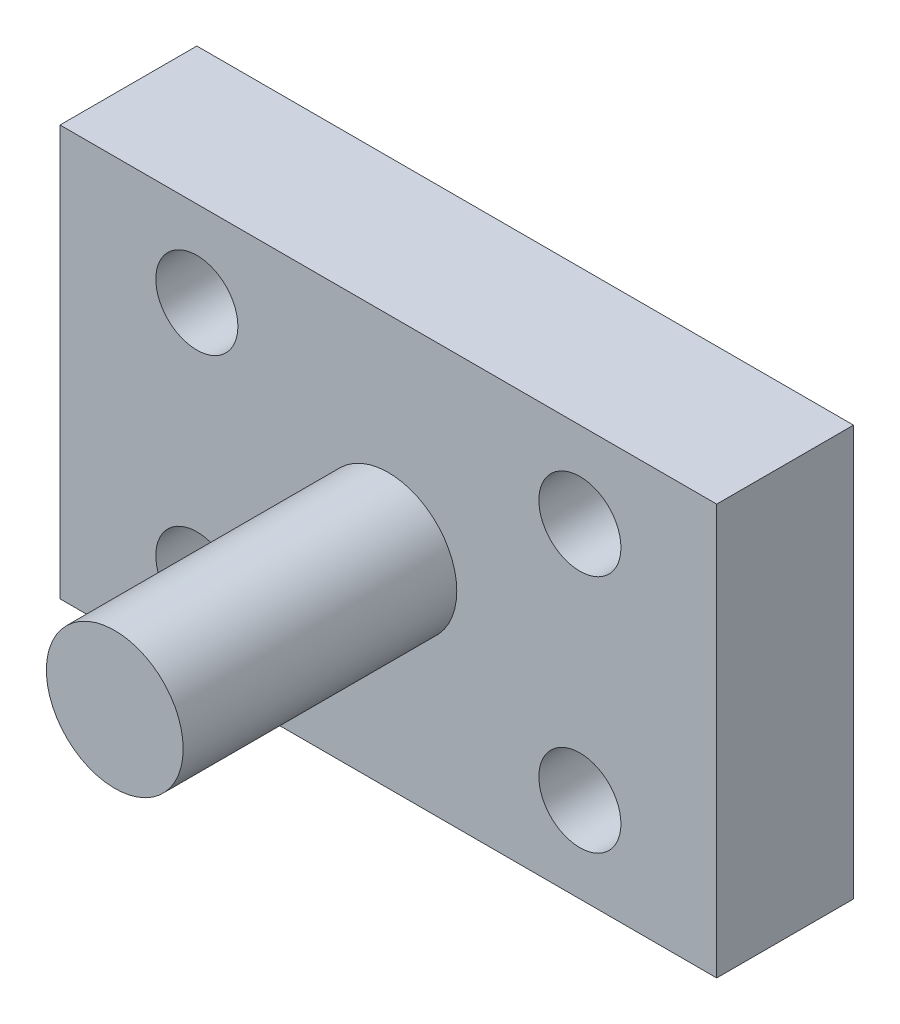
ISO-10303-21;
HEADER;
FILE_DESCRIPTION(('STEP AP214'),'2;1');
FILE_NAME('part.step','',(''),(''),'','','');
FILE_SCHEMA(('AUTOMOTIVE_DESIGN { 1 0 10303 214 1 1 1 1 }'));
ENDSEC;
DATA;
#1=APPLICATION_CONTEXT('core data for automotive mechanical design processes');
#2=APPLICATION_PROTOCOL_DEFINITION('international standard','automotive_design',2000,#1);
#3=PRODUCT_CONTEXT('',#1,'mechanical');
#4=PRODUCT('Part','Part','',(#3));
#5=PRODUCT_RELATED_PRODUCT_CATEGORY('part','',(#4));
#6=PRODUCT_DEFINITION_FORMATION('','',#4);
#7=PRODUCT_DEFINITION_CONTEXT('part definition',#1,'design');
#8=PRODUCT_DEFINITION('design','',#6,#7);
#9=PRODUCT_DEFINITION_SHAPE('','',#8);
#10=(LENGTH_UNIT() NAMED_UNIT(*) SI_UNIT(.MILLI.,.METRE.));
#11=(NAMED_UNIT(*) PLANE_ANGLE_UNIT() SI_UNIT($,.RADIAN.));
#12=(NAMED_UNIT(*) SI_UNIT($,.STERADIAN.) SOLID_ANGLE_UNIT());
#13=UNCERTAINTY_MEASURE_WITH_UNIT(LENGTH_MEASURE(1.E-05),#10,'distance_accuracy_value','');
#14=(GEOMETRIC_REPRESENTATION_CONTEXT(3) GLOBAL_UNCERTAINTY_ASSIGNED_CONTEXT((#13)) GLOBAL_UNIT_ASSIGNED_CONTEXT((#10,
#11,#12)) REPRESENTATION_CONTEXT('',''));
#15=CARTESIAN_POINT('',(0.,0.,0.));
#16=DIRECTION('',(0.,0.,1.));
#17=DIRECTION('',(1.,0.,0.));
#18=AXIS2_PLACEMENT_3D('',#15,#16,#17);
#19=CARTESIAN_POINT('',(0.,0.,25.));
#20=DIRECTION('',(0.,0.,1.));
#21=DIRECTION('',(1.,0.,0.));
#22=AXIS2_PLACEMENT_3D('',#19,#20,#21);
#23=PLANE('',#22);
#24=CARTESIAN_POINT('',(0.,0.,25.));
#25=DIRECTION('',(0.,0.,1.));
#26=DIRECTION('',(1.,0.,0.));
#27=AXIS2_PLACEMENT_3D('',#24,#25,#26);
#28=CIRCLE('',#27,12.5);
#29=CARTESIAN_POINT('',(12.5,0.,25.));
#30=VERTEX_POINT('',#29);
#31=EDGE_CURVE('E138',#30,#30,#28,.T.);
#32=ORIENTED_EDGE('',*,*,#31,.F.);
#33=EDGE_LOOP('',(#32));
#34=FACE_BOUND('',#33,.T.);
#35=CARTESIAN_POINT('',(-35.,-21.875,25.));
#36=DIRECTION('',(0.,0.,1.));
#37=DIRECTION('',(1.,0.,0.));
#38=AXIS2_PLACEMENT_3D('',#35,#36,#37);
#39=CIRCLE('',#38,7.5);
#40=CARTESIAN_POINT('',(-27.5,-21.875,25.));
#41=VERTEX_POINT('',#40);
#42=EDGE_CURVE('E123',#41,#41,#39,.T.);
#43=ORIENTED_EDGE('',*,*,#42,.F.);
#44=EDGE_LOOP('',(#43));
#45=FACE_BOUND('',#44,.T.);
#46=CARTESIAN_POINT('',(35.,21.875,25.));
#47=DIRECTION('',(0.,0.,1.));
#48=DIRECTION('',(1.,0.,0.));
#49=AXIS2_PLACEMENT_3D('',#46,#47,#48);
#50=CIRCLE('',#49,7.5);
#51=CARTESIAN_POINT('',(42.5,21.875,25.));
#52=VERTEX_POINT('',#51);
#53=EDGE_CURVE('E102',#52,#52,#50,.T.);
#54=ORIENTED_EDGE('',*,*,#53,.F.);
#55=EDGE_LOOP('',(#54));
#56=FACE_BOUND('',#55,.T.);
#57=DIRECTION('',(0.,1.,0.));
#58=VECTOR('',#57,1.);
#59=CARTESIAN_POINT('',(60.,37.5,25.));
#60=LINE('',#59,#58);
#61=CARTESIAN_POINT('',(60.,-37.5,25.));
#62=VERTEX_POINT('',#61);
#63=CARTESIAN_POINT('',(60.,37.5,25.));
#64=VERTEX_POINT('',#63);
#65=EDGE_CURVE('E87',#62,#64,#60,.T.);
#66=ORIENTED_EDGE('',*,*,#65,.T.);
#67=DIRECTION('',(-1.,0.,0.));
#68=VECTOR('',#67,1.);
#69=CARTESIAN_POINT('',(-60.,37.5,25.));
#70=LINE('',#69,#68);
#71=CARTESIAN_POINT('',(-60.,37.5,25.));
#72=VERTEX_POINT('',#71);
#73=EDGE_CURVE('E82',#64,#72,#70,.T.);
#74=ORIENTED_EDGE('',*,*,#73,.T.);
#75=DIRECTION('',(0.,-1.,0.));
#76=VECTOR('',#75,1.);
#77=CARTESIAN_POINT('',(-60.,37.5,25.));
#78=LINE('',#77,#76);
#79=CARTESIAN_POINT('',(-60.,-37.5,25.));
#80=VERTEX_POINT('',#79);
#81=EDGE_CURVE('E85',#72,#80,#78,.T.);
#82=ORIENTED_EDGE('',*,*,#81,.T.);
#83=DIRECTION('',(1.,0.,0.));
#84=VECTOR('',#83,1.);
#85=CARTESIAN_POINT('',(-60.,-37.5,25.));
#86=LINE('',#85,#84);
#87=EDGE_CURVE('E52',#80,#62,#86,.T.);
#88=ORIENTED_EDGE('',*,*,#87,.T.);
#89=EDGE_LOOP('',(#66,#74,#82,#88));
#90=FACE_BOUND('',#89,.T.);
#91=CARTESIAN_POINT('',(-35.,21.875,25.));
#92=DIRECTION('',(0.,0.,1.));
#93=DIRECTION('',(1.,0.,0.));
#94=AXIS2_PLACEMENT_3D('',#91,#92,#93);
#95=CIRCLE('',#94,7.5);
#96=CARTESIAN_POINT('',(-27.5,21.875,25.));
#97=VERTEX_POINT('',#96);
#98=EDGE_CURVE('E117',#97,#97,#95,.T.);
#99=ORIENTED_EDGE('',*,*,#98,.F.);
#100=EDGE_LOOP('',(#99));
#101=FACE_BOUND('',#100,.T.);
#102=CARTESIAN_POINT('',(35.,-21.875,25.));
#103=DIRECTION('',(0.,0.,1.));
#104=DIRECTION('',(1.,0.,0.));
#105=AXIS2_PLACEMENT_3D('',#102,#103,#104);
#106=CIRCLE('',#105,7.5);
#107=CARTESIAN_POINT('',(42.5,-21.875,25.));
#108=VERTEX_POINT('',#107);
#109=EDGE_CURVE('E129',#108,#108,#106,.T.);
#110=ORIENTED_EDGE('',*,*,#109,.F.);
#111=EDGE_LOOP('',(#110));
#112=FACE_BOUND('',#111,.T.);
#113=ADVANCED_FACE('F35',(#34,#45,#56,#90,#101,#112),#23,.T.);
#114=CARTESIAN_POINT('',(0.,0.,0.));
#115=DIRECTION('',(0.,0.,1.));
#116=DIRECTION('',(1.,0.,0.));
#117=AXIS2_PLACEMENT_3D('',#114,#115,#116);
#118=PLANE('',#117);
#119=DIRECTION('',(0.,1.,0.));
#120=VECTOR('',#119,1.);
#121=CARTESIAN_POINT('',(60.,37.5,0.));
#122=LINE('',#121,#120);
#123=CARTESIAN_POINT('',(60.,-37.5,0.));
#124=VERTEX_POINT('',#123);
#125=CARTESIAN_POINT('',(60.,37.5,0.));
#126=VERTEX_POINT('',#125);
#127=EDGE_CURVE('E99',#124,#126,#122,.T.);
#128=ORIENTED_EDGE('',*,*,#127,.F.);
#129=DIRECTION('',(1.,0.,0.));
#130=VECTOR('',#129,1.);
#131=CARTESIAN_POINT('',(-60.,-37.5,0.));
#132=LINE('',#131,#130);
#133=CARTESIAN_POINT('',(-60.,-37.5,0.));
#134=VERTEX_POINT('',#133);
#135=EDGE_CURVE('E75',#134,#124,#132,.T.);
#136=ORIENTED_EDGE('',*,*,#135,.F.);
#137=DIRECTION('',(0.,-1.,0.));
#138=VECTOR('',#137,1.);
#139=CARTESIAN_POINT('',(-60.,37.5,0.));
#140=LINE('',#139,#138);
#141=CARTESIAN_POINT('',(-60.,37.5,0.));
#142=VERTEX_POINT('',#141);
#143=EDGE_CURVE('E69',#142,#134,#140,.T.);
#144=ORIENTED_EDGE('',*,*,#143,.F.);
#145=DIRECTION('',(-1.,0.,0.));
#146=VECTOR('',#145,1.);
#147=CARTESIAN_POINT('',(-60.,37.5,0.));
#148=LINE('',#147,#146);
#149=EDGE_CURVE('E91',#126,#142,#148,.T.);
#150=ORIENTED_EDGE('',*,*,#149,.F.);
#151=EDGE_LOOP('',(#128,#136,#144,#150));
#152=FACE_BOUND('',#151,.T.);
#153=CARTESIAN_POINT('',(35.,21.875,0.));
#154=DIRECTION('',(0.,0.,1.));
#155=DIRECTION('',(1.,0.,0.));
#156=AXIS2_PLACEMENT_3D('',#153,#154,#155);
#157=CIRCLE('',#156,7.5);
#158=CARTESIAN_POINT('',(42.5,21.875,0.));
#159=VERTEX_POINT('',#158);
#160=EDGE_CURVE('E114',#159,#159,#157,.T.);
#161=ORIENTED_EDGE('',*,*,#160,.T.);
#162=EDGE_LOOP('',(#161));
#163=FACE_BOUND('',#162,.T.);
#164=CARTESIAN_POINT('',(-35.,21.875,0.));
#165=DIRECTION('',(0.,0.,1.));
#166=DIRECTION('',(1.,0.,0.));
#167=AXIS2_PLACEMENT_3D('',#164,#165,#166);
#168=CIRCLE('',#167,7.5);
#169=CARTESIAN_POINT('',(-27.5,21.875,0.));
#170=VERTEX_POINT('',#169);
#171=EDGE_CURVE('E120',#170,#170,#168,.T.);
#172=ORIENTED_EDGE('',*,*,#171,.T.);
#173=EDGE_LOOP('',(#172));
#174=FACE_BOUND('',#173,.T.);
#175=CARTESIAN_POINT('',(-35.,-21.875,0.));
#176=DIRECTION('',(0.,0.,1.));
#177=DIRECTION('',(1.,0.,0.));
#178=AXIS2_PLACEMENT_3D('',#175,#176,#177);
#179=CIRCLE('',#178,7.5);
#180=CARTESIAN_POINT('',(-27.5,-21.875,0.));
#181=VERTEX_POINT('',#180);
#182=EDGE_CURVE('E126',#181,#181,#179,.T.);
#183=ORIENTED_EDGE('',*,*,#182,.T.);
#184=EDGE_LOOP('',(#183));
#185=FACE_BOUND('',#184,.T.);
#186=CARTESIAN_POINT('',(35.,-21.875,0.));
#187=DIRECTION('',(0.,0.,1.));
#188=DIRECTION('',(1.,0.,0.));
#189=AXIS2_PLACEMENT_3D('',#186,#187,#188);
#190=CIRCLE('',#189,7.5);
#191=CARTESIAN_POINT('',(42.5,-21.875,0.));
#192=VERTEX_POINT('',#191);
#193=EDGE_CURVE('E132',#192,#192,#190,.T.);
#194=ORIENTED_EDGE('',*,*,#193,.T.);
#195=EDGE_LOOP('',(#194));
#196=FACE_BOUND('',#195,.T.);
#197=ADVANCED_FACE('F110',(#152,#163,#174,#185,#196),#118,.F.);
#198=CARTESIAN_POINT('',(60.,37.5,25.));
#199=DIRECTION('',(-1.,0.,0.));
#200=DIRECTION('',(0.,0.,1.));
#201=AXIS2_PLACEMENT_3D('',#198,#199,#200);
#202=PLANE('',#201);
#203=ORIENTED_EDGE('',*,*,#127,.T.);
#204=DIRECTION('',(0.,0.,-1.));
#205=VECTOR('',#204,1.);
#206=CARTESIAN_POINT('',(60.,37.5,25.));
#207=LINE('',#206,#205);
#208=EDGE_CURVE('E11',#64,#126,#207,.T.);
#209=ORIENTED_EDGE('',*,*,#208,.F.);
#210=ORIENTED_EDGE('',*,*,#65,.F.);
#211=DIRECTION('',(0.,0.,-1.));
#212=VECTOR('',#211,1.);
#213=CARTESIAN_POINT('',(60.,-37.5,25.));
#214=LINE('',#213,#212);
#215=EDGE_CURVE('E95',#62,#124,#214,.T.);
#216=ORIENTED_EDGE('',*,*,#215,.T.);
#217=EDGE_LOOP('',(#203,#209,#210,#216));
#218=FACE_BOUND('',#217,.T.);
#219=ADVANCED_FACE('F37',(#218),#202,.F.);
#220=CARTESIAN_POINT('',(-60.,37.5,25.));
#221=DIRECTION('',(0.,-1.,0.));
#222=DIRECTION('',(0.,0.,-1.));
#223=AXIS2_PLACEMENT_3D('',#220,#221,#222);
#224=PLANE('',#223);
#225=ORIENTED_EDGE('',*,*,#149,.T.);
#226=DIRECTION('',(0.,0.,-1.));
#227=VECTOR('',#226,1.);
#228=CARTESIAN_POINT('',(-60.,37.5,25.));
#229=LINE('',#228,#227);
#230=EDGE_CURVE('E44',#72,#142,#229,.T.);
#231=ORIENTED_EDGE('',*,*,#230,.F.);
#232=ORIENTED_EDGE('',*,*,#73,.F.);
#233=ORIENTED_EDGE('',*,*,#208,.T.);
#234=EDGE_LOOP('',(#225,#231,#232,#233));
#235=FACE_BOUND('',#234,.T.);
#236=ADVANCED_FACE('F90',(#235),#224,.F.);
#237=CARTESIAN_POINT('',(-60.,37.5,25.));
#238=DIRECTION('',(1.,0.,0.));
#239=DIRECTION('',(0.,1.,0.));
#240=AXIS2_PLACEMENT_3D('',#237,#238,#239);
#241=PLANE('',#240);
#242=ORIENTED_EDGE('',*,*,#143,.T.);
#243=DIRECTION('',(0.,0.,-1.));
#244=VECTOR('',#243,1.);
#245=CARTESIAN_POINT('',(-60.,-37.5,25.));
#246=LINE('',#245,#244);
#247=EDGE_CURVE('E92',#80,#134,#246,.T.);
#248=ORIENTED_EDGE('',*,*,#247,.F.);
#249=ORIENTED_EDGE('',*,*,#81,.F.);
#250=ORIENTED_EDGE('',*,*,#230,.T.);
#251=EDGE_LOOP('',(#242,#248,#249,#250));
#252=FACE_BOUND('',#251,.T.);
#253=ADVANCED_FACE('F93',(#252),#241,.F.);
#254=CARTESIAN_POINT('',(-60.,-37.5,25.));
#255=DIRECTION('',(0.,1.,0.));
#256=DIRECTION('',(0.,0.,1.));
#257=AXIS2_PLACEMENT_3D('',#254,#255,#256);
#258=PLANE('',#257);
#259=ORIENTED_EDGE('',*,*,#135,.T.);
#260=ORIENTED_EDGE('',*,*,#215,.F.);
#261=ORIENTED_EDGE('',*,*,#87,.F.);
#262=ORIENTED_EDGE('',*,*,#247,.T.);
#263=EDGE_LOOP('',(#259,#260,#261,#262));
#264=FACE_BOUND('',#263,.T.);
#265=ADVANCED_FACE('F107',(#264),#258,.F.);
#266=CARTESIAN_POINT('',(35.,21.875,25.));
#267=DIRECTION('',(0.,0.,-1.));
#268=DIRECTION('',(-1.,0.,0.));
#269=AXIS2_PLACEMENT_3D('',#266,#267,#268);
#270=CYLINDRICAL_SURFACE('',#269,7.5);
#271=ORIENTED_EDGE('',*,*,#53,.T.);
#272=EDGE_LOOP('',(#271));
#273=FACE_BOUND('',#272,.T.);
#274=ORIENTED_EDGE('',*,*,#160,.F.);
#275=EDGE_LOOP('',(#274));
#276=FACE_BOUND('',#275,.T.);
#277=ADVANCED_FACE('F160',(#273,#276),#270,.F.);
#278=CARTESIAN_POINT('',(-35.,21.875,25.));
#279=DIRECTION('',(0.,0.,-1.));
#280=DIRECTION('',(-1.,0.,0.));
#281=AXIS2_PLACEMENT_3D('',#278,#279,#280);
#282=CYLINDRICAL_SURFACE('',#281,7.5);
#283=ORIENTED_EDGE('',*,*,#98,.T.);
#284=EDGE_LOOP('',(#283));
#285=FACE_BOUND('',#284,.T.);
#286=ORIENTED_EDGE('',*,*,#171,.F.);
#287=EDGE_LOOP('',(#286));
#288=FACE_BOUND('',#287,.T.);
#289=ADVANCED_FACE('F163',(#285,#288),#282,.F.);
#290=CARTESIAN_POINT('',(-35.,-21.875,25.));
#291=DIRECTION('',(0.,0.,-1.));
#292=DIRECTION('',(-1.,0.,0.));
#293=AXIS2_PLACEMENT_3D('',#290,#291,#292);
#294=CYLINDRICAL_SURFACE('',#293,7.5);
#295=ORIENTED_EDGE('',*,*,#42,.T.);
#296=EDGE_LOOP('',(#295));
#297=FACE_BOUND('',#296,.T.);
#298=ORIENTED_EDGE('',*,*,#182,.F.);
#299=EDGE_LOOP('',(#298));
#300=FACE_BOUND('',#299,.T.);
#301=ADVANCED_FACE('F176',(#297,#300),#294,.F.);
#302=CARTESIAN_POINT('',(35.,-21.875,25.));
#303=DIRECTION('',(0.,0.,-1.));
#304=DIRECTION('',(-1.,0.,0.));
#305=AXIS2_PLACEMENT_3D('',#302,#303,#304);
#306=CYLINDRICAL_SURFACE('',#305,7.5);
#307=ORIENTED_EDGE('',*,*,#109,.T.);
#308=EDGE_LOOP('',(#307));
#309=FACE_BOUND('',#308,.T.);
#310=ORIENTED_EDGE('',*,*,#193,.F.);
#311=EDGE_LOOP('',(#310));
#312=FACE_BOUND('',#311,.T.);
#313=ADVANCED_FACE('F149',(#309,#312),#306,.F.);
#314=CARTESIAN_POINT('',(0.,0.,75.));
#315=DIRECTION('',(0.,0.,-1.));
#316=DIRECTION('',(-1.,0.,0.));
#317=AXIS2_PLACEMENT_3D('',#314,#315,#316);
#318=CYLINDRICAL_SURFACE('',#317,12.5);
#319=CARTESIAN_POINT('',(0.,0.,75.));
#320=DIRECTION('',(0.,0.,1.));
#321=DIRECTION('',(1.,0.,0.));
#322=AXIS2_PLACEMENT_3D('',#319,#320,#321);
#323=CIRCLE('',#322,12.5);
#324=CARTESIAN_POINT('',(12.5,0.,75.));
#325=VERTEX_POINT('',#324);
#326=EDGE_CURVE('E135',#325,#325,#323,.T.);
#327=ORIENTED_EDGE('',*,*,#326,.F.);
#328=EDGE_LOOP('',(#327));
#329=FACE_BOUND('',#328,.T.);
#330=ORIENTED_EDGE('',*,*,#31,.T.);
#331=EDGE_LOOP('',(#330));
#332=FACE_BOUND('',#331,.T.);
#333=ADVANCED_FACE('F146',(#329,#332),#318,.T.);
#334=CARTESIAN_POINT('',(0.,0.,75.));
#335=DIRECTION('',(0.,0.,1.));
#336=DIRECTION('',(1.,0.,0.));
#337=AXIS2_PLACEMENT_3D('',#334,#335,#336);
#338=PLANE('',#337);
#339=ORIENTED_EDGE('',*,*,#326,.T.);
#340=EDGE_LOOP('',(#339));
#341=FACE_BOUND('',#340,.T.);
#342=ADVANCED_FACE('F144',(#341),#338,.T.);
#343=CLOSED_SHELL('',(#113,#197,#219,#236,#253,#265,#277,#289,#301,#313,#333,#342));
#344=MANIFOLD_SOLID_BREP('B2',#343);
#345=ADVANCED_BREP_SHAPE_REPRESENTATION('',(#18,#344),#14);
#346=SHAPE_DEFINITION_REPRESENTATION(#9,#345);
ENDSEC;
END-ISO-10303-21;
